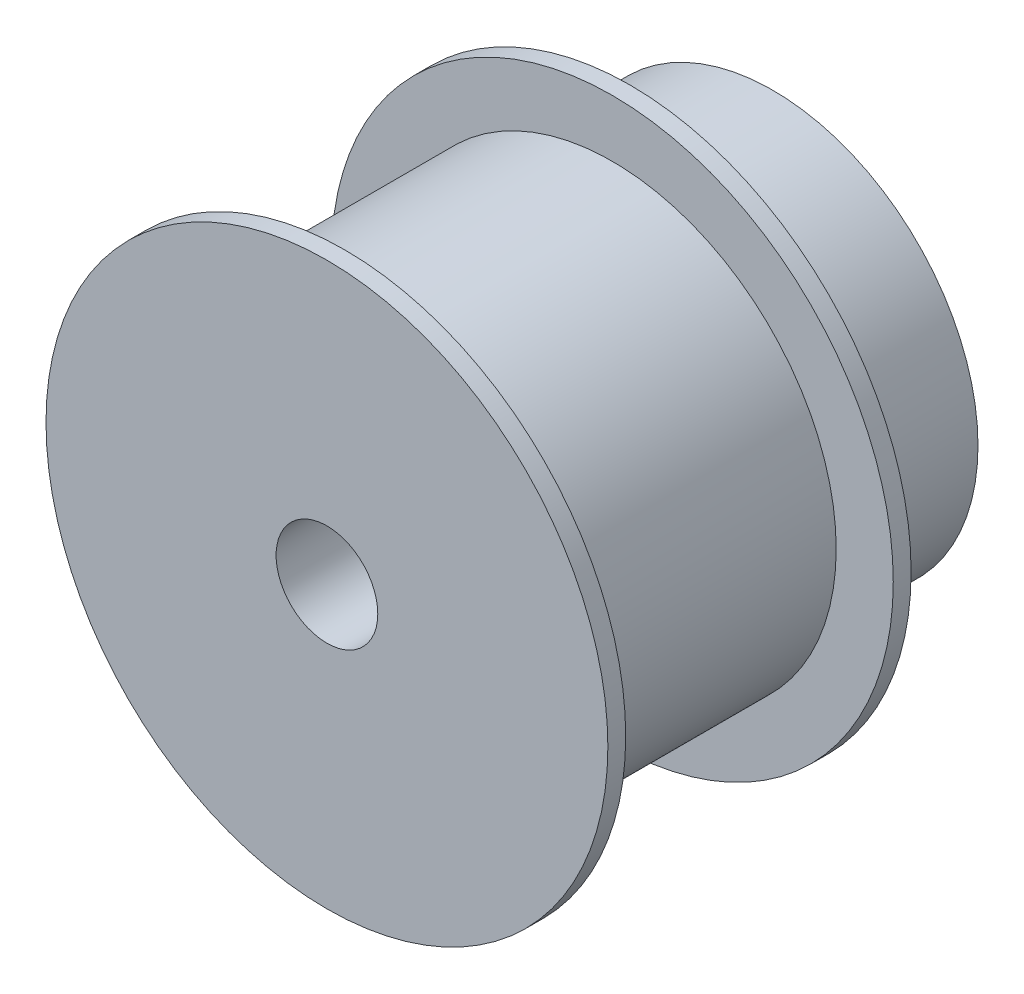
ISO-10303-21;
HEADER;
FILE_DESCRIPTION(('STEP AP214'),'2;1');
FILE_NAME('part.step','',(''),(''),'','','');
FILE_SCHEMA(('AUTOMOTIVE_DESIGN { 1 0 10303 214 1 1 1 1 }'));
ENDSEC;
DATA;
#1=APPLICATION_CONTEXT('core data for automotive mechanical design processes');
#2=APPLICATION_PROTOCOL_DEFINITION('international standard','automotive_design',2000,#1);
#3=PRODUCT_CONTEXT('',#1,'mechanical');
#4=PRODUCT('Part','Part','',(#3));
#5=PRODUCT_RELATED_PRODUCT_CATEGORY('part','',(#4));
#6=PRODUCT_DEFINITION_FORMATION('','',#4);
#7=PRODUCT_DEFINITION_CONTEXT('part definition',#1,'design');
#8=PRODUCT_DEFINITION('design','',#6,#7);
#9=PRODUCT_DEFINITION_SHAPE('','',#8);
#10=(LENGTH_UNIT() NAMED_UNIT(*) SI_UNIT(.MILLI.,.METRE.));
#11=(NAMED_UNIT(*) PLANE_ANGLE_UNIT() SI_UNIT($,.RADIAN.));
#12=(NAMED_UNIT(*) SI_UNIT($,.STERADIAN.) SOLID_ANGLE_UNIT());
#13=UNCERTAINTY_MEASURE_WITH_UNIT(LENGTH_MEASURE(1.E-05),#10,'distance_accuracy_value','');
#14=(GEOMETRIC_REPRESENTATION_CONTEXT(3) GLOBAL_UNCERTAINTY_ASSIGNED_CONTEXT((#13)) GLOBAL_UNIT_ASSIGNED_CONTEXT((#10,
#11,#12)) REPRESENTATION_CONTEXT('',''));
#15=CARTESIAN_POINT('',(0.,0.,0.));
#16=DIRECTION('',(0.,0.,1.));
#17=DIRECTION('',(1.,0.,0.));
#18=AXIS2_PLACEMENT_3D('',#15,#16,#17);
#19=CARTESIAN_POINT('',(12.55,0.,9.));
#20=DIRECTION('',(0.,0.,1.));
#21=DIRECTION('',(1.,0.,0.));
#22=AXIS2_PLACEMENT_3D('',#19,#20,#21);
#23=PLANE('',#22);
#24=CARTESIAN_POINT('',(0.,0.,9.));
#25=DIRECTION('',(0.,0.,1.));
#26=DIRECTION('',(1.,0.,0.));
#27=AXIS2_PLACEMENT_3D('',#24,#25,#26);
#28=CIRCLE('',#27,15.75);
#29=CARTESIAN_POINT('',(15.75,0.,9.));
#30=VERTEX_POINT('',#29);
#31=EDGE_CURVE('E10',#30,#30,#28,.T.);
#32=ORIENTED_EDGE('',*,*,#31,.T.);
#33=EDGE_LOOP('',(#32));
#34=FACE_BOUND('',#33,.T.);
#35=CARTESIAN_POINT('',(0.,0.,9.));
#36=DIRECTION('',(0.,0.,1.));
#37=DIRECTION('',(1.,0.,0.));
#38=AXIS2_PLACEMENT_3D('',#35,#36,#37);
#39=CIRCLE('',#38,12.55);
#40=CARTESIAN_POINT('',(12.55,0.,9.));
#41=VERTEX_POINT('',#40);
#42=EDGE_CURVE('E65',#41,#41,#39,.T.);
#43=ORIENTED_EDGE('',*,*,#42,.F.);
#44=EDGE_LOOP('',(#43));
#45=FACE_BOUND('',#44,.T.);
#46=ADVANCED_FACE('F31',(#34,#45),#23,.T.);
#47=CARTESIAN_POINT('',(0.,0.,0.));
#48=DIRECTION('',(0.,0.,1.));
#49=DIRECTION('',(1.,0.,0.));
#50=AXIS2_PLACEMENT_3D('',#47,#48,#49);
#51=CYLINDRICAL_SURFACE('',#50,15.75);
#52=CARTESIAN_POINT('',(0.,0.,8.));
#53=DIRECTION('',(0.,0.,1.));
#54=DIRECTION('',(1.,0.,0.));
#55=AXIS2_PLACEMENT_3D('',#52,#53,#54);
#56=CIRCLE('',#55,15.75);
#57=CARTESIAN_POINT('',(15.75,0.,8.));
#58=VERTEX_POINT('',#57);
#59=EDGE_CURVE('E37',#58,#58,#56,.T.);
#60=ORIENTED_EDGE('',*,*,#59,.T.);
#61=EDGE_LOOP('',(#60));
#62=FACE_BOUND('',#61,.T.);
#63=ORIENTED_EDGE('',*,*,#31,.F.);
#64=EDGE_LOOP('',(#63));
#65=FACE_BOUND('',#64,.T.);
#66=ADVANCED_FACE('F73',(#62,#65),#51,.T.);
#67=CARTESIAN_POINT('',(15.75,0.,8.));
#68=DIRECTION('',(0.,0.,-1.));
#69=DIRECTION('',(-1.,0.,0.));
#70=AXIS2_PLACEMENT_3D('',#67,#68,#69);
#71=PLANE('',#70);
#72=CARTESIAN_POINT('',(0.,0.,8.));
#73=DIRECTION('',(0.,0.,1.));
#74=DIRECTION('',(1.,0.,0.));
#75=AXIS2_PLACEMENT_3D('',#72,#73,#74);
#76=CIRCLE('',#75,11.5);
#77=CARTESIAN_POINT('',(11.5,0.,8.));
#78=VERTEX_POINT('',#77);
#79=EDGE_CURVE('E41',#78,#78,#76,.T.);
#80=ORIENTED_EDGE('',*,*,#79,.T.);
#81=EDGE_LOOP('',(#80));
#82=FACE_BOUND('',#81,.T.);
#83=ORIENTED_EDGE('',*,*,#59,.F.);
#84=EDGE_LOOP('',(#83));
#85=FACE_BOUND('',#84,.T.);
#86=ADVANCED_FACE('F77',(#82,#85),#71,.T.);
#87=CARTESIAN_POINT('',(0.,0.,0.));
#88=DIRECTION('',(0.,0.,1.));
#89=DIRECTION('',(1.,0.,0.));
#90=AXIS2_PLACEMENT_3D('',#87,#88,#89);
#91=CYLINDRICAL_SURFACE('',#90,11.5);
#92=CARTESIAN_POINT('',(0.,0.,0.));
#93=DIRECTION('',(0.,0.,1.));
#94=DIRECTION('',(1.,0.,0.));
#95=AXIS2_PLACEMENT_3D('',#92,#93,#94);
#96=CIRCLE('',#95,11.5);
#97=CARTESIAN_POINT('',(11.5,0.,0.));
#98=VERTEX_POINT('',#97);
#99=EDGE_CURVE('E45',#98,#98,#96,.T.);
#100=ORIENTED_EDGE('',*,*,#99,.T.);
#101=EDGE_LOOP('',(#100));
#102=FACE_BOUND('',#101,.T.);
#103=ORIENTED_EDGE('',*,*,#79,.F.);
#104=EDGE_LOOP('',(#103));
#105=FACE_BOUND('',#104,.T.);
#106=ADVANCED_FACE('F81',(#102,#105),#91,.T.);
#107=CARTESIAN_POINT('',(11.5,0.,0.));
#108=DIRECTION('',(0.,0.,-1.));
#109=DIRECTION('',(-1.,0.,0.));
#110=AXIS2_PLACEMENT_3D('',#107,#108,#109);
#111=PLANE('',#110);
#112=CARTESIAN_POINT('',(0.,0.,0.));
#113=DIRECTION('',(0.,0.,1.));
#114=DIRECTION('',(1.,0.,0.));
#115=AXIS2_PLACEMENT_3D('',#112,#113,#114);
#116=CIRCLE('',#115,2.85);
#117=CARTESIAN_POINT('',(2.85,0.,0.));
#118=VERTEX_POINT('',#117);
#119=EDGE_CURVE('E50',#118,#118,#116,.T.);
#120=ORIENTED_EDGE('',*,*,#119,.T.);
#121=EDGE_LOOP('',(#120));
#122=FACE_BOUND('',#121,.T.);
#123=ORIENTED_EDGE('',*,*,#99,.F.);
#124=EDGE_LOOP('',(#123));
#125=FACE_BOUND('',#124,.T.);
#126=ADVANCED_FACE('F88',(#122,#125),#111,.T.);
#127=CARTESIAN_POINT('',(0.,0.,0.));
#128=DIRECTION('',(0.,0.,1.));
#129=DIRECTION('',(1.,0.,0.));
#130=AXIS2_PLACEMENT_3D('',#127,#128,#129);
#131=CYLINDRICAL_SURFACE('',#130,2.85);
#132=CARTESIAN_POINT('',(0.,0.,25.));
#133=DIRECTION('',(0.,0.,1.));
#134=DIRECTION('',(1.,0.,0.));
#135=AXIS2_PLACEMENT_3D('',#132,#133,#134);
#136=CIRCLE('',#135,2.85);
#137=CARTESIAN_POINT('',(2.85,0.,25.));
#138=VERTEX_POINT('',#137);
#139=EDGE_CURVE('E53',#138,#138,#136,.T.);
#140=ORIENTED_EDGE('',*,*,#139,.T.);
#141=EDGE_LOOP('',(#140));
#142=FACE_BOUND('',#141,.T.);
#143=ORIENTED_EDGE('',*,*,#119,.F.);
#144=EDGE_LOOP('',(#143));
#145=FACE_BOUND('',#144,.T.);
#146=ADVANCED_FACE('F92',(#142,#145),#131,.F.);
#147=CARTESIAN_POINT('',(2.85,0.,25.));
#148=DIRECTION('',(0.,0.,1.));
#149=DIRECTION('',(1.,0.,0.));
#150=AXIS2_PLACEMENT_3D('',#147,#148,#149);
#151=PLANE('',#150);
#152=CARTESIAN_POINT('',(0.,0.,25.));
#153=DIRECTION('',(0.,0.,1.));
#154=DIRECTION('',(1.,0.,0.));
#155=AXIS2_PLACEMENT_3D('',#152,#153,#154);
#156=CIRCLE('',#155,15.75);
#157=CARTESIAN_POINT('',(15.75,0.,25.));
#158=VERTEX_POINT('',#157);
#159=EDGE_CURVE('E56',#158,#158,#156,.T.);
#160=ORIENTED_EDGE('',*,*,#159,.T.);
#161=EDGE_LOOP('',(#160));
#162=FACE_BOUND('',#161,.T.);
#163=ORIENTED_EDGE('',*,*,#139,.F.);
#164=EDGE_LOOP('',(#163));
#165=FACE_BOUND('',#164,.T.);
#166=ADVANCED_FACE('F96',(#162,#165),#151,.T.);
#167=CARTESIAN_POINT('',(0.,0.,0.));
#168=DIRECTION('',(0.,0.,1.));
#169=DIRECTION('',(1.,0.,0.));
#170=AXIS2_PLACEMENT_3D('',#167,#168,#169);
#171=CYLINDRICAL_SURFACE('',#170,15.75);
#172=CARTESIAN_POINT('',(0.,0.,24.));
#173=DIRECTION('',(0.,0.,1.));
#174=DIRECTION('',(1.,0.,0.));
#175=AXIS2_PLACEMENT_3D('',#172,#173,#174);
#176=CIRCLE('',#175,15.75);
#177=CARTESIAN_POINT('',(15.75,0.,24.));
#178=VERTEX_POINT('',#177);
#179=EDGE_CURVE('E59',#178,#178,#176,.T.);
#180=ORIENTED_EDGE('',*,*,#179,.T.);
#181=EDGE_LOOP('',(#180));
#182=FACE_BOUND('',#181,.T.);
#183=ORIENTED_EDGE('',*,*,#159,.F.);
#184=EDGE_LOOP('',(#183));
#185=FACE_BOUND('',#184,.T.);
#186=ADVANCED_FACE('F100',(#182,#185),#171,.T.);
#187=CARTESIAN_POINT('',(15.75,0.,24.));
#188=DIRECTION('',(0.,0.,-1.));
#189=DIRECTION('',(-1.,0.,0.));
#190=AXIS2_PLACEMENT_3D('',#187,#188,#189);
#191=PLANE('',#190);
#192=CARTESIAN_POINT('',(0.,0.,24.));
#193=DIRECTION('',(0.,0.,1.));
#194=DIRECTION('',(1.,0.,0.));
#195=AXIS2_PLACEMENT_3D('',#192,#193,#194);
#196=CIRCLE('',#195,12.55);
#197=CARTESIAN_POINT('',(12.55,0.,24.));
#198=VERTEX_POINT('',#197);
#199=EDGE_CURVE('E62',#198,#198,#196,.T.);
#200=ORIENTED_EDGE('',*,*,#199,.T.);
#201=EDGE_LOOP('',(#200));
#202=FACE_BOUND('',#201,.T.);
#203=ORIENTED_EDGE('',*,*,#179,.F.);
#204=EDGE_LOOP('',(#203));
#205=FACE_BOUND('',#204,.T.);
#206=ADVANCED_FACE('F104',(#202,#205),#191,.T.);
#207=CARTESIAN_POINT('',(0.,0.,0.));
#208=DIRECTION('',(0.,0.,1.));
#209=DIRECTION('',(1.,0.,0.));
#210=AXIS2_PLACEMENT_3D('',#207,#208,#209);
#211=CYLINDRICAL_SURFACE('',#210,12.55);
#212=ORIENTED_EDGE('',*,*,#42,.T.);
#213=EDGE_LOOP('',(#212));
#214=FACE_BOUND('',#213,.T.);
#215=ORIENTED_EDGE('',*,*,#199,.F.);
#216=EDGE_LOOP('',(#215));
#217=FACE_BOUND('',#216,.T.);
#218=ADVANCED_FACE('F69',(#214,#217),#211,.T.);
#219=CLOSED_SHELL('',(#46,#66,#86,#106,#126,#146,#166,#186,#206,#218));
#220=MANIFOLD_SOLID_BREP('B2',#219);
#221=ADVANCED_BREP_SHAPE_REPRESENTATION('',(#18,#220),#14);
#222=SHAPE_DEFINITION_REPRESENTATION(#9,#221);
ENDSEC;
END-ISO-10303-21;
